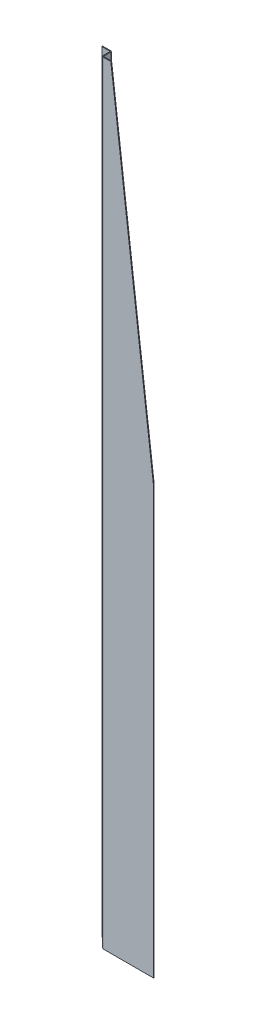
ISO-10303-21;
HEADER;
FILE_DESCRIPTION(('STEP AP214'),'2;1');
FILE_NAME('part.step','',(''),(''),'','','');
FILE_SCHEMA(('AUTOMOTIVE_DESIGN { 1 0 10303 214 1 1 1 1 }'));
ENDSEC;
DATA;
#1=APPLICATION_CONTEXT('core data for automotive mechanical design processes');
#2=APPLICATION_PROTOCOL_DEFINITION('international standard','automotive_design',2000,#1);
#3=PRODUCT_CONTEXT('',#1,'mechanical');
#4=PRODUCT('Part','Part','',(#3));
#5=PRODUCT_RELATED_PRODUCT_CATEGORY('part','',(#4));
#6=PRODUCT_DEFINITION_FORMATION('','',#4);
#7=PRODUCT_DEFINITION_CONTEXT('part definition',#1,'design');
#8=PRODUCT_DEFINITION('design','',#6,#7);
#9=PRODUCT_DEFINITION_SHAPE('','',#8);
#10=(LENGTH_UNIT() NAMED_UNIT(*) SI_UNIT(.MILLI.,.METRE.));
#11=(NAMED_UNIT(*) PLANE_ANGLE_UNIT() SI_UNIT($,.RADIAN.));
#12=(NAMED_UNIT(*) SI_UNIT($,.STERADIAN.) SOLID_ANGLE_UNIT());
#13=UNCERTAINTY_MEASURE_WITH_UNIT(LENGTH_MEASURE(1.E-05),#10,'distance_accuracy_value','');
#14=(GEOMETRIC_REPRESENTATION_CONTEXT(3) GLOBAL_UNCERTAINTY_ASSIGNED_CONTEXT((#13)) GLOBAL_UNIT_ASSIGNED_CONTEXT((#10,
#11,#12)) REPRESENTATION_CONTEXT('',''));
#15=CARTESIAN_POINT('',(0.,0.,0.));
#16=DIRECTION('',(0.,0.,1.));
#17=DIRECTION('',(1.,0.,0.));
#18=AXIS2_PLACEMENT_3D('',#15,#16,#17);
#19=CARTESIAN_POINT('',(-60.5,1810.,-21.9));
#20=DIRECTION('',(0.,0.,1.));
#21=DIRECTION('',(1.,0.,0.));
#22=AXIS2_PLACEMENT_3D('',#19,#20,#21);
#23=PLANE('',#22);
#24=DIRECTION('',(1.,0.,0.));
#25=VECTOR('',#24,1.);
#26=CARTESIAN_POINT('',(-60.5,1808.1,-21.9));
#27=LINE('',#26,#25);
#28=CARTESIAN_POINT('',(-80.5,1808.1,-21.9));
#29=VERTEX_POINT('',#28);
#30=CARTESIAN_POINT('',(-61.2366,1808.1,-21.9));
#31=VERTEX_POINT('',#30);
#32=EDGE_CURVE('E333',#29,#31,#27,.T.);
#33=ORIENTED_EDGE('',*,*,#32,.T.);
#34=DIRECTION('',(0.,-1.,0.));
#35=VECTOR('',#34,1.);
#36=CARTESIAN_POINT('',(-61.2366,1810.,-21.9));
#37=LINE('',#36,#35);
#38=CARTESIAN_POINT('',(-61.2366,1.90000000000001,-21.9));
#39=VERTEX_POINT('',#38);
#40=EDGE_CURVE('E69',#31,#39,#37,.T.);
#41=ORIENTED_EDGE('',*,*,#40,.T.);
#42=DIRECTION('',(1.,0.,0.));
#43=VECTOR('',#42,1.);
#44=CARTESIAN_POINT('',(-60.5,1.90000000000001,-21.9));
#45=LINE('',#44,#43);
#46=CARTESIAN_POINT('',(-80.5,1.90000000000001,-21.9));
#47=VERTEX_POINT('',#46);
#48=EDGE_CURVE('E209',#39,#47,#45,.F.);
#49=ORIENTED_EDGE('',*,*,#48,.T.);
#50=DIRECTION('',(0.,-1.,0.));
#51=VECTOR('',#50,1.);
#52=CARTESIAN_POINT('',(-80.5,1810.,-21.9));
#53=LINE('',#52,#51);
#54=EDGE_CURVE('E54',#29,#47,#53,.T.);
#55=ORIENTED_EDGE('',*,*,#54,.F.);
#56=EDGE_LOOP('',(#33,#41,#49,#55));
#57=FACE_BOUND('',#56,.T.);
#58=ADVANCED_FACE('F45',(#57),#23,.F.);
#59=CARTESIAN_POINT('',(-80.5,1810.,-20.));
#60=DIRECTION('',(-1.,0.,0.));
#61=DIRECTION('',(0.,0.,1.));
#62=AXIS2_PLACEMENT_3D('',#59,#60,#61);
#63=PLANE('',#62);
#64=DIRECTION('',(0.,-1.,0.));
#65=VECTOR('',#64,1.);
#66=CARTESIAN_POINT('',(-80.5,1810.,-20.));
#67=LINE('',#66,#65);
#68=CARTESIAN_POINT('',(-80.5,1808.1,-20.));
#69=VERTEX_POINT('',#68);
#70=CARTESIAN_POINT('',(-80.5,1.90000000000001,-20.));
#71=VERTEX_POINT('',#70);
#72=EDGE_CURVE('E189',#69,#71,#67,.T.);
#73=ORIENTED_EDGE('',*,*,#72,.F.);
#74=DIRECTION('',(0.,0.,1.));
#75=VECTOR('',#74,1.);
#76=CARTESIAN_POINT('',(-80.5,1808.1,-21.9));
#77=LINE('',#76,#75);
#78=EDGE_CURVE('E204',#69,#29,#77,.F.);
#79=ORIENTED_EDGE('',*,*,#78,.T.);
#80=ORIENTED_EDGE('',*,*,#54,.T.);
#81=DIRECTION('',(0.,0.,1.));
#82=VECTOR('',#81,1.);
#83=CARTESIAN_POINT('',(-80.5,1.9,-20.));
#84=LINE('',#83,#82);
#85=EDGE_CURVE('E203',#71,#47,#84,.F.);
#86=ORIENTED_EDGE('',*,*,#85,.F.);
#87=EDGE_LOOP('',(#73,#79,#80,#86));
#88=FACE_BOUND('',#87,.T.);
#89=ADVANCED_FACE('F202',(#88),#63,.T.);
#90=CARTESIAN_POINT('',(-60.5,1810.,-20.));
#91=DIRECTION('',(0.,0.,1.));
#92=DIRECTION('',(1.,0.,0.));
#93=AXIS2_PLACEMENT_3D('',#90,#91,#92);
#94=PLANE('',#93);
#95=DIRECTION('',(0.,-1.,0.));
#96=VECTOR('',#95,1.);
#97=CARTESIAN_POINT('',(-61.2366,1810.,-20.));
#98=LINE('',#97,#96);
#99=CARTESIAN_POINT('',(-61.2366,1808.1,-20.));
#100=VERTEX_POINT('',#99);
#101=CARTESIAN_POINT('',(-61.2366,1.90000000000001,-20.));
#102=VERTEX_POINT('',#101);
#103=EDGE_CURVE('E187',#100,#102,#98,.T.);
#104=ORIENTED_EDGE('',*,*,#103,.F.);
#105=DIRECTION('',(1.,0.,0.));
#106=VECTOR('',#105,1.);
#107=CARTESIAN_POINT('',(-70.8683,1808.1,-20.));
#108=LINE('',#107,#106);
#109=EDGE_CURVE('E181',#69,#100,#108,.T.);
#110=ORIENTED_EDGE('',*,*,#109,.F.);
#111=ORIENTED_EDGE('',*,*,#72,.T.);
#112=DIRECTION('',(-1.,0.,0.));
#113=VECTOR('',#112,1.);
#114=CARTESIAN_POINT('',(-60.5,1.90000000000001,-20.));
#115=LINE('',#114,#113);
#116=EDGE_CURVE('E212',#102,#71,#115,.T.);
#117=ORIENTED_EDGE('',*,*,#116,.F.);
#118=EDGE_LOOP('',(#104,#110,#111,#117));
#119=FACE_BOUND('',#118,.T.);
#120=ADVANCED_FACE('F356',(#119),#94,.T.);
#121=CARTESIAN_POINT('',(-61.2366,1810.,-19.2634));
#122=DIRECTION('',(0.,-1.,0.));
#123=DIRECTION('',(0.,0.,-1.));
#124=AXIS2_PLACEMENT_3D('',#121,#122,#123);
#125=CYLINDRICAL_SURFACE('',#124,0.7366);
#126=DIRECTION('',(0.,-1.,0.));
#127=VECTOR('',#126,1.);
#128=CARTESIAN_POINT('',(-60.5,1810.,-19.2634));
#129=LINE('',#128,#127);
#130=CARTESIAN_POINT('',(-60.5,1808.1,-19.2634));
#131=VERTEX_POINT('',#130);
#132=CARTESIAN_POINT('',(-60.5,1.90000000000001,-19.2634));
#133=VERTEX_POINT('',#132);
#134=EDGE_CURVE('E178',#131,#133,#129,.T.);
#135=ORIENTED_EDGE('',*,*,#134,.F.);
#136=CARTESIAN_POINT('',(-61.2366,1808.1,-19.2634));
#137=DIRECTION('',(0.,1.,0.));
#138=DIRECTION('',(0.,0.,1.));
#139=AXIS2_PLACEMENT_3D('',#136,#137,#138);
#140=CIRCLE('',#139,0.736599999999999);
#141=EDGE_CURVE('E150',#131,#100,#140,.T.);
#142=ORIENTED_EDGE('',*,*,#141,.T.);
#143=ORIENTED_EDGE('',*,*,#103,.T.);
#144=CARTESIAN_POINT('',(-61.2366,1.90000000000001,-19.2634));
#145=DIRECTION('',(0.,-1.,0.));
#146=DIRECTION('',(1.,0.,0.));
#147=AXIS2_PLACEMENT_3D('',#144,#145,#146);
#148=CIRCLE('',#147,0.736600000000002);
#149=EDGE_CURVE('E186',#102,#133,#148,.T.);
#150=ORIENTED_EDGE('',*,*,#149,.T.);
#151=EDGE_LOOP('',(#135,#142,#143,#150));
#152=FACE_BOUND('',#151,.T.);
#153=ADVANCED_FACE('F184',(#152),#125,.F.);
#154=CARTESIAN_POINT('',(-60.5,1810.,0.));
#155=DIRECTION('',(-1.,0.,0.));
#156=DIRECTION('',(0.,0.,1.));
#157=AXIS2_PLACEMENT_3D('',#154,#155,#156);
#158=PLANE('',#157);
#159=DIRECTION('',(0.,-1.,0.));
#160=VECTOR('',#159,1.);
#161=CARTESIAN_POINT('',(-60.5,1810.,-2.63659999999998));
#162=LINE('',#161,#160);
#163=CARTESIAN_POINT('',(-60.5,1808.1,-2.63659999999998));
#164=VERTEX_POINT('',#163);
#165=CARTESIAN_POINT('',(-60.5,1.90000000000001,-2.63659999999998));
#166=VERTEX_POINT('',#165);
#167=EDGE_CURVE('E180',#164,#166,#162,.T.);
#168=ORIENTED_EDGE('',*,*,#167,.F.);
#169=DIRECTION('',(0.,0.,-1.));
#170=VECTOR('',#169,1.);
#171=CARTESIAN_POINT('',(-60.5,1808.1,0.));
#172=LINE('',#171,#170);
#173=EDGE_CURVE('E166',#164,#131,#172,.T.);
#174=ORIENTED_EDGE('',*,*,#173,.T.);
#175=ORIENTED_EDGE('',*,*,#134,.T.);
#176=DIRECTION('',(0.,0.,-1.));
#177=VECTOR('',#176,1.);
#178=CARTESIAN_POINT('',(-60.5,1.90000000000001,2.22044604925031E-13));
#179=LINE('',#178,#177);
#180=EDGE_CURVE('E160',#166,#133,#179,.T.);
#181=ORIENTED_EDGE('',*,*,#180,.F.);
#182=EDGE_LOOP('',(#168,#174,#175,#181));
#183=FACE_BOUND('',#182,.T.);
#184=ADVANCED_FACE('F176',(#183),#158,.T.);
#185=CARTESIAN_POINT('',(-57.8634,1810.,-2.63659999999998));
#186=DIRECTION('',(0.,-1.,0.));
#187=DIRECTION('',(0.,0.,-1.));
#188=AXIS2_PLACEMENT_3D('',#185,#186,#187);
#189=CYLINDRICAL_SURFACE('',#188,2.6366);
#190=DIRECTION('',(0.,-1.,0.));
#191=VECTOR('',#190,1.);
#192=CARTESIAN_POINT('',(-57.8634,1810.,0.));
#193=LINE('',#192,#191);
#194=CARTESIAN_POINT('',(-57.8634,1808.1,0.));
#195=VERTEX_POINT('',#194);
#196=CARTESIAN_POINT('',(-57.8634,1.90000000000001,0.));
#197=VERTEX_POINT('',#196);
#198=EDGE_CURVE('E191',#195,#197,#193,.T.);
#199=ORIENTED_EDGE('',*,*,#198,.F.);
#200=CARTESIAN_POINT('',(-57.8634,1808.1,-2.63659999999998));
#201=DIRECTION('',(0.,-1.,0.));
#202=DIRECTION('',(0.,0.,-1.));
#203=AXIS2_PLACEMENT_3D('',#200,#201,#202);
#204=CIRCLE('',#203,2.6366);
#205=EDGE_CURVE('E172',#195,#164,#204,.T.);
#206=ORIENTED_EDGE('',*,*,#205,.T.);
#207=ORIENTED_EDGE('',*,*,#167,.T.);
#208=CARTESIAN_POINT('',(-57.8634,1.90000000000001,-2.63659999999998));
#209=DIRECTION('',(0.,1.,0.));
#210=DIRECTION('',(0.,0.,1.));
#211=AXIS2_PLACEMENT_3D('',#208,#209,#210);
#212=CIRCLE('',#211,2.6366);
#213=EDGE_CURVE('E228',#166,#197,#212,.T.);
#214=ORIENTED_EDGE('',*,*,#213,.T.);
#215=EDGE_LOOP('',(#199,#206,#207,#214));
#216=FACE_BOUND('',#215,.T.);
#217=ADVANCED_FACE('F272',(#216),#189,.T.);
#218=CARTESIAN_POINT('',(-57.8634,1810.,-2.63659999999998));
#219=DIRECTION('',(0.,-1.,0.));
#220=DIRECTION('',(0.,0.,-1.));
#221=AXIS2_PLACEMENT_3D('',#218,#219,#220);
#222=CYLINDRICAL_SURFACE('',#221,0.7366);
#223=CARTESIAN_POINT('',(-57.8634,1808.1,-2.63659999999998));
#224=DIRECTION('',(0.,-1.,0.));
#225=DIRECTION('',(0.,0.,-1.));
#226=AXIS2_PLACEMENT_3D('',#223,#224,#225);
#227=CIRCLE('',#226,0.7366);
#228=CARTESIAN_POINT('',(-57.8634,1808.1,-1.89999999999998));
#229=VERTEX_POINT('',#228);
#230=CARTESIAN_POINT('',(-58.6,1808.1,-2.63659999999998));
#231=VERTEX_POINT('',#230);
#232=EDGE_CURVE('E303',#229,#231,#227,.T.);
#233=ORIENTED_EDGE('',*,*,#232,.F.);
#234=DIRECTION('',(0.,-1.,0.));
#235=VECTOR('',#234,1.);
#236=CARTESIAN_POINT('',(-57.8634,1810.,-1.89999999999998));
#237=LINE('',#236,#235);
#238=CARTESIAN_POINT('',(-57.8634,1.90000000000001,-1.89999999999998));
#239=VERTEX_POINT('',#238);
#240=EDGE_CURVE('E250',#229,#239,#237,.T.);
#241=ORIENTED_EDGE('',*,*,#240,.T.);
#242=CARTESIAN_POINT('',(-57.8634,1.90000000000001,-2.63659999999998));
#243=DIRECTION('',(0.,-1.,0.));
#244=DIRECTION('',(0.,0.,-1.));
#245=AXIS2_PLACEMENT_3D('',#242,#243,#244);
#246=CIRCLE('',#245,0.7366);
#247=CARTESIAN_POINT('',(-58.6,1.90000000000001,-2.63659999999998));
#248=VERTEX_POINT('',#247);
#249=EDGE_CURVE('E225',#248,#239,#246,.F.);
#250=ORIENTED_EDGE('',*,*,#249,.F.);
#251=DIRECTION('',(0.,-1.,0.));
#252=VECTOR('',#251,1.);
#253=CARTESIAN_POINT('',(-58.6,1810.,-2.63659999999998));
#254=LINE('',#253,#252);
#255=EDGE_CURVE('E248',#231,#248,#254,.T.);
#256=ORIENTED_EDGE('',*,*,#255,.F.);
#257=EDGE_LOOP('',(#233,#241,#250,#256));
#258=FACE_BOUND('',#257,.T.);
#259=ADVANCED_FACE('F302',(#258),#222,.F.);
#260=CARTESIAN_POINT('',(-58.6,1810.,0.));
#261=DIRECTION('',(-1.,0.,0.));
#262=DIRECTION('',(0.,0.,1.));
#263=AXIS2_PLACEMENT_3D('',#260,#261,#262);
#264=PLANE('',#263);
#265=DIRECTION('',(0.,0.,-1.));
#266=VECTOR('',#265,1.);
#267=CARTESIAN_POINT('',(-58.6,1808.1,-10.95));
#268=LINE('',#267,#266);
#269=CARTESIAN_POINT('',(-58.6,1808.1,-19.2634));
#270=VERTEX_POINT('',#269);
#271=EDGE_CURVE('E169',#231,#270,#268,.T.);
#272=ORIENTED_EDGE('',*,*,#271,.F.);
#273=ORIENTED_EDGE('',*,*,#255,.T.);
#274=DIRECTION('',(0.,0.,1.));
#275=VECTOR('',#274,1.);
#276=CARTESIAN_POINT('',(-58.6,1.90000000000001,0.));
#277=LINE('',#276,#275);
#278=CARTESIAN_POINT('',(-58.6,1.90000000000001,-19.2634));
#279=VERTEX_POINT('',#278);
#280=EDGE_CURVE('E281',#248,#279,#277,.F.);
#281=ORIENTED_EDGE('',*,*,#280,.T.);
#282=DIRECTION('',(0.,-1.,0.));
#283=VECTOR('',#282,1.);
#284=CARTESIAN_POINT('',(-58.6,1810.,-19.2634));
#285=LINE('',#284,#283);
#286=EDGE_CURVE('E246',#270,#279,#285,.T.);
#287=ORIENTED_EDGE('',*,*,#286,.F.);
#288=EDGE_LOOP('',(#272,#273,#281,#287));
#289=FACE_BOUND('',#288,.T.);
#290=ADVANCED_FACE('F298',(#289),#264,.F.);
#291=CARTESIAN_POINT('',(-61.2366,1810.,-19.2634));
#292=DIRECTION('',(0.,-1.,0.));
#293=DIRECTION('',(0.,0.,-1.));
#294=AXIS2_PLACEMENT_3D('',#291,#292,#293);
#295=CYLINDRICAL_SURFACE('',#294,2.6366);
#296=CARTESIAN_POINT('',(-61.2366,1808.1,-19.2634));
#297=DIRECTION('',(0.,-1.,0.));
#298=DIRECTION('',(0.,0.,-1.));
#299=AXIS2_PLACEMENT_3D('',#296,#297,#298);
#300=CIRCLE('',#299,2.6366);
#301=EDGE_CURVE('E171',#270,#31,#300,.F.);
#302=ORIENTED_EDGE('',*,*,#301,.F.);
#303=ORIENTED_EDGE('',*,*,#286,.T.);
#304=CARTESIAN_POINT('',(-61.2366,1.90000000000001,-19.2634));
#305=DIRECTION('',(0.,-1.,0.));
#306=DIRECTION('',(1.,0.,0.));
#307=AXIS2_PLACEMENT_3D('',#304,#305,#306);
#308=CIRCLE('',#307,2.6366);
#309=EDGE_CURVE('E284',#39,#279,#308,.T.);
#310=ORIENTED_EDGE('',*,*,#309,.F.);
#311=ORIENTED_EDGE('',*,*,#40,.F.);
#312=EDGE_LOOP('',(#302,#303,#310,#311));
#313=FACE_BOUND('',#312,.T.);
#314=ADVANCED_FACE('F342',(#313),#295,.T.);
#315=CARTESIAN_POINT('',(60.5,1810.,0.));
#316=DIRECTION('',(0.,0.,1.));
#317=DIRECTION('',(1.,0.,0.));
#318=AXIS2_PLACEMENT_3D('',#315,#316,#317);
#319=PLANE('',#318);
#320=DIRECTION('',(0.122526572002646,-0.992465233221436,0.));
#321=VECTOR('',#320,1.);
#322=CARTESIAN_POINT('',(60.5,1000.,0.));
#323=LINE('',#322,#321);
#324=CARTESIAN_POINT('',(-39.2654320987654,1808.1,0.));
#325=VERTEX_POINT('',#324);
#326=CARTESIAN_POINT('',(60.5,1000.,0.));
#327=VERTEX_POINT('',#326);
#328=EDGE_CURVE('E49',#325,#327,#323,.T.);
#329=ORIENTED_EDGE('',*,*,#328,.F.);
#330=DIRECTION('',(-1.,0.,0.));
#331=VECTOR('',#330,1.);
#332=CARTESIAN_POINT('',(60.5,1808.1,0.));
#333=LINE('',#332,#331);
#334=EDGE_CURVE('E61',#325,#195,#333,.T.);
#335=ORIENTED_EDGE('',*,*,#334,.T.);
#336=ORIENTED_EDGE('',*,*,#198,.T.);
#337=DIRECTION('',(0.,-1.,0.));
#338=VECTOR('',#337,1.);
#339=CARTESIAN_POINT('',(-57.8634,1810.,0.));
#340=LINE('',#339,#338);
#341=CARTESIAN_POINT('',(-57.8634,0.,0.));
#342=VERTEX_POINT('',#341);
#343=EDGE_CURVE('E216',#197,#342,#340,.T.);
#344=ORIENTED_EDGE('',*,*,#343,.T.);
#345=DIRECTION('',(-1.,0.,0.));
#346=VECTOR('',#345,1.);
#347=CARTESIAN_POINT('',(60.5,0.,0.));
#348=LINE('',#347,#346);
#349=CARTESIAN_POINT('',(60.5,0.,0.));
#350=VERTEX_POINT('',#349);
#351=EDGE_CURVE('E236',#350,#342,#348,.T.);
#352=ORIENTED_EDGE('',*,*,#351,.F.);
#353=DIRECTION('',(0.,-1.,0.));
#354=VECTOR('',#353,1.);
#355=CARTESIAN_POINT('',(60.5,1810.,0.));
#356=LINE('',#355,#354);
#357=EDGE_CURVE('E254',#327,#350,#356,.T.);
#358=ORIENTED_EDGE('',*,*,#357,.F.);
#359=EDGE_LOOP('',(#329,#335,#336,#344,#352,#358));
#360=FACE_BOUND('',#359,.T.);
#361=ADVANCED_FACE('F258',(#360),#319,.T.);
#362=CARTESIAN_POINT('',(60.5,1810.,-1.89999999999998));
#363=DIRECTION('',(0.,0.,1.));
#364=DIRECTION('',(1.,0.,0.));
#365=AXIS2_PLACEMENT_3D('',#362,#363,#364);
#366=PLANE('',#365);
#367=DIRECTION('',(-1.,0.,0.));
#368=VECTOR('',#367,1.);
#369=CARTESIAN_POINT('',(-48.5644160493827,1808.1,-1.89999999999998));
#370=LINE('',#369,#368);
#371=CARTESIAN_POINT('',(-39.2654320987654,1808.1,-1.89999999999998));
#372=VERTEX_POINT('',#371);
#373=EDGE_CURVE('E309',#372,#229,#370,.T.);
#374=ORIENTED_EDGE('',*,*,#373,.F.);
#375=DIRECTION('',(0.122526572002646,-0.992465233221436,0.));
#376=VECTOR('',#375,1.);
#377=CARTESIAN_POINT('',(-37.998723915328,1797.83966371416,-1.89999999999998));
#378=LINE('',#377,#376);
#379=CARTESIAN_POINT('',(60.5,1000.,-1.89999999999998));
#380=VERTEX_POINT('',#379);
#381=EDGE_CURVE('E234',#372,#380,#378,.T.);
#382=ORIENTED_EDGE('',*,*,#381,.T.);
#383=DIRECTION('',(0.,-1.,0.));
#384=VECTOR('',#383,1.);
#385=CARTESIAN_POINT('',(60.5,1810.,-1.89999999999998));
#386=LINE('',#385,#384);
#387=CARTESIAN_POINT('',(60.5,0.,-1.89999999999998));
#388=VERTEX_POINT('',#387);
#389=EDGE_CURVE('E252',#380,#388,#386,.T.);
#390=ORIENTED_EDGE('',*,*,#389,.T.);
#391=DIRECTION('',(1.,0.,0.));
#392=VECTOR('',#391,1.);
#393=CARTESIAN_POINT('',(60.5,0.,-1.89999999999998));
#394=LINE('',#393,#392);
#395=CARTESIAN_POINT('',(-57.8634,0.,-1.89999999999998));
#396=VERTEX_POINT('',#395);
#397=EDGE_CURVE('E242',#388,#396,#394,.F.);
#398=ORIENTED_EDGE('',*,*,#397,.T.);
#399=DIRECTION('',(0.,-1.,0.));
#400=VECTOR('',#399,1.);
#401=CARTESIAN_POINT('',(-57.8634,1810.,-1.89999999999998));
#402=LINE('',#401,#400);
#403=EDGE_CURVE('E214',#239,#396,#402,.T.);
#404=ORIENTED_EDGE('',*,*,#403,.F.);
#405=ORIENTED_EDGE('',*,*,#240,.F.);
#406=EDGE_LOOP('',(#374,#382,#390,#398,#404,#405));
#407=FACE_BOUND('',#406,.T.);
#408=ADVANCED_FACE('F307',(#407),#366,.F.);
#409=CARTESIAN_POINT('',(60.5,1000.,-21.9));
#410=DIRECTION('',(-0.992465233221436,-0.122526572002646,0.));
#411=DIRECTION('',(0.122526572002646,-0.992465233221436,0.));
#412=AXIS2_PLACEMENT_3D('',#409,#410,#411);
#413=PLANE('',#412);
#414=DIRECTION('',(0.,0.,-1.));
#415=VECTOR('',#414,1.);
#416=CARTESIAN_POINT('',(-39.2654320987654,1808.1,0.));
#417=LINE('',#416,#415);
#418=EDGE_CURVE('E321',#372,#325,#417,.F.);
#419=ORIENTED_EDGE('',*,*,#418,.T.);
#420=ORIENTED_EDGE('',*,*,#328,.T.);
#421=DIRECTION('',(0.,0.,1.));
#422=VECTOR('',#421,1.);
#423=CARTESIAN_POINT('',(60.5,1000.,-21.9));
#424=LINE('',#423,#422);
#425=EDGE_CURVE('E231',#380,#327,#424,.T.);
#426=ORIENTED_EDGE('',*,*,#425,.F.);
#427=ORIENTED_EDGE('',*,*,#381,.F.);
#428=EDGE_LOOP('',(#419,#420,#426,#427));
#429=FACE_BOUND('',#428,.T.);
#430=ADVANCED_FACE('F320',(#429),#413,.F.);
#431=CARTESIAN_POINT('',(-58.6,0.,-2.63659999999998));
#432=DIRECTION('',(0.,-1.,0.));
#433=DIRECTION('',(0.,0.,-1.));
#434=AXIS2_PLACEMENT_3D('',#431,#432,#433);
#435=PLANE('',#434);
#436=ORIENTED_EDGE('',*,*,#351,.T.);
#437=DIRECTION('',(0.,0.,-1.));
#438=VECTOR('',#437,1.);
#439=CARTESIAN_POINT('',(-57.8634,0.,0.));
#440=LINE('',#439,#438);
#441=EDGE_CURVE('E11',#342,#396,#440,.T.);
#442=ORIENTED_EDGE('',*,*,#441,.T.);
#443=ORIENTED_EDGE('',*,*,#397,.F.);
#444=DIRECTION('',(0.,0.,1.));
#445=VECTOR('',#444,1.);
#446=CARTESIAN_POINT('',(60.5,0.,-1.89999999999998));
#447=LINE('',#446,#445);
#448=EDGE_CURVE('E239',#388,#350,#447,.T.);
#449=ORIENTED_EDGE('',*,*,#448,.T.);
#450=EDGE_LOOP('',(#436,#442,#443,#449));
#451=FACE_BOUND('',#450,.T.);
#452=ADVANCED_FACE('F47',(#451),#435,.T.);
#453=CARTESIAN_POINT('',(60.5,1810.,-1.89999999999998));
#454=DIRECTION('',(1.,0.,0.));
#455=DIRECTION('',(0.,0.,-1.));
#456=AXIS2_PLACEMENT_3D('',#453,#454,#455);
#457=PLANE('',#456);
#458=ORIENTED_EDGE('',*,*,#425,.T.);
#459=ORIENTED_EDGE('',*,*,#357,.T.);
#460=ORIENTED_EDGE('',*,*,#448,.F.);
#461=ORIENTED_EDGE('',*,*,#389,.F.);
#462=EDGE_LOOP('',(#458,#459,#460,#461));
#463=FACE_BOUND('',#462,.T.);
#464=ADVANCED_FACE('F316',(#463),#457,.T.);
#465=CARTESIAN_POINT('',(-57.8634,1.90000000000001,-2.63659999999998));
#466=DIRECTION('',(0.,-1.,0.));
#467=DIRECTION('',(0.,0.,-1.));
#468=AXIS2_PLACEMENT_3D('',#465,#466,#467);
#469=PLANE('',#468);
#470=DIRECTION('',(1.,0.,0.));
#471=VECTOR('',#470,1.);
#472=CARTESIAN_POINT('',(-60.5,1.90000000000001,-2.63659999999998));
#473=LINE('',#472,#471);
#474=EDGE_CURVE('E277',#166,#248,#473,.T.);
#475=ORIENTED_EDGE('',*,*,#474,.T.);
#476=ORIENTED_EDGE('',*,*,#249,.T.);
#477=DIRECTION('',(0.,0.,1.));
#478=VECTOR('',#477,1.);
#479=CARTESIAN_POINT('',(-57.8634,1.90000000000001,-1.89999999999998));
#480=LINE('',#479,#478);
#481=EDGE_CURVE('E222',#239,#197,#480,.T.);
#482=ORIENTED_EDGE('',*,*,#481,.T.);
#483=ORIENTED_EDGE('',*,*,#213,.F.);
#484=EDGE_LOOP('',(#475,#476,#482,#483));
#485=FACE_BOUND('',#484,.T.);
#486=ADVANCED_FACE('F267',(#485),#469,.T.);
#487=CARTESIAN_POINT('',(-57.8634,0.950000000000006,-1.89999999999998));
#488=DIRECTION('',(-1.,0.,0.));
#489=DIRECTION('',(0.,-1.,0.));
#490=AXIS2_PLACEMENT_3D('',#487,#488,#489);
#491=PLANE('',#490);
#492=ORIENTED_EDGE('',*,*,#403,.T.);
#493=ORIENTED_EDGE('',*,*,#441,.F.);
#494=ORIENTED_EDGE('',*,*,#343,.F.);
#495=ORIENTED_EDGE('',*,*,#481,.F.);
#496=EDGE_LOOP('',(#492,#493,#494,#495));
#497=FACE_BOUND('',#496,.T.);
#498=ADVANCED_FACE('F271',(#497),#491,.T.);
#499=CARTESIAN_POINT('',(-60.5,1.90000000000001,-20.));
#500=DIRECTION('',(0.,1.,0.));
#501=DIRECTION('',(-1.,0.,0.));
#502=AXIS2_PLACEMENT_3D('',#499,#500,#501);
#503=PLANE('',#502);
#504=ORIENTED_EDGE('',*,*,#116,.T.);
#505=ORIENTED_EDGE('',*,*,#85,.T.);
#506=ORIENTED_EDGE('',*,*,#48,.F.);
#507=DIRECTION('',(0.,0.,-1.));
#508=VECTOR('',#507,1.);
#509=CARTESIAN_POINT('',(-61.2366,1.90000000000001,-20.));
#510=LINE('',#509,#508);
#511=EDGE_CURVE('E282',#102,#39,#510,.T.);
#512=ORIENTED_EDGE('',*,*,#511,.F.);
#513=EDGE_LOOP('',(#504,#505,#506,#512));
#514=FACE_BOUND('',#513,.T.);
#515=ADVANCED_FACE('F207',(#514),#503,.F.);
#516=CARTESIAN_POINT('',(-61.2366,1.90000000000001,-19.2634));
#517=DIRECTION('',(0.,1.,0.));
#518=DIRECTION('',(-1.,0.,0.));
#519=AXIS2_PLACEMENT_3D('',#516,#517,#518);
#520=PLANE('',#519);
#521=ORIENTED_EDGE('',*,*,#511,.T.);
#522=ORIENTED_EDGE('',*,*,#309,.T.);
#523=DIRECTION('',(1.,0.,0.));
#524=VECTOR('',#523,1.);
#525=CARTESIAN_POINT('',(-60.5,1.90000000000001,-19.2634));
#526=LINE('',#525,#524);
#527=EDGE_CURVE('E286',#133,#279,#526,.T.);
#528=ORIENTED_EDGE('',*,*,#527,.F.);
#529=ORIENTED_EDGE('',*,*,#149,.F.);
#530=EDGE_LOOP('',(#521,#522,#528,#529));
#531=FACE_BOUND('',#530,.T.);
#532=ADVANCED_FACE('F294',(#531),#520,.F.);
#533=CARTESIAN_POINT('',(-60.5,1.90000000000001,2.22044604925031E-13));
#534=DIRECTION('',(0.,1.,0.));
#535=DIRECTION('',(0.,0.,-1.));
#536=AXIS2_PLACEMENT_3D('',#533,#534,#535);
#537=PLANE('',#536);
#538=ORIENTED_EDGE('',*,*,#180,.T.);
#539=ORIENTED_EDGE('',*,*,#527,.T.);
#540=ORIENTED_EDGE('',*,*,#280,.F.);
#541=ORIENTED_EDGE('',*,*,#474,.F.);
#542=EDGE_LOOP('',(#538,#539,#540,#541));
#543=FACE_BOUND('',#542,.T.);
#544=ADVANCED_FACE('F278',(#543),#537,.F.);
#545=CARTESIAN_POINT('',(-60.5,1808.1,0.));
#546=DIRECTION('',(0.,-1.,0.));
#547=DIRECTION('',(0.,0.,-1.));
#548=AXIS2_PLACEMENT_3D('',#545,#546,#547);
#549=PLANE('',#548);
#550=DIRECTION('',(-1.,0.,0.));
#551=VECTOR('',#550,1.);
#552=CARTESIAN_POINT('',(-58.6,1808.1,-2.63659999999998));
#553=LINE('',#552,#551);
#554=EDGE_CURVE('E327',#231,#164,#553,.T.);
#555=ORIENTED_EDGE('',*,*,#554,.F.);
#556=ORIENTED_EDGE('',*,*,#271,.T.);
#557=DIRECTION('',(-1.,0.,0.));
#558=VECTOR('',#557,1.);
#559=CARTESIAN_POINT('',(-58.6,1808.1,-19.2634));
#560=LINE('',#559,#558);
#561=EDGE_CURVE('E153',#270,#131,#560,.T.);
#562=ORIENTED_EDGE('',*,*,#561,.T.);
#563=ORIENTED_EDGE('',*,*,#173,.F.);
#564=EDGE_LOOP('',(#555,#556,#562,#563));
#565=FACE_BOUND('',#564,.T.);
#566=ADVANCED_FACE('F165',(#565),#549,.F.);
#567=CARTESIAN_POINT('',(-57.8634,1808.1,-2.63659999999998));
#568=DIRECTION('',(0.,1.,0.));
#569=DIRECTION('',(0.,0.,1.));
#570=AXIS2_PLACEMENT_3D('',#567,#568,#569);
#571=PLANE('',#570);
#572=ORIENTED_EDGE('',*,*,#232,.T.);
#573=ORIENTED_EDGE('',*,*,#554,.T.);
#574=ORIENTED_EDGE('',*,*,#205,.F.);
#575=DIRECTION('',(0.,0.,1.));
#576=VECTOR('',#575,1.);
#577=CARTESIAN_POINT('',(-57.8634,1808.1,-1.89999999999998));
#578=LINE('',#577,#576);
#579=EDGE_CURVE('E329',#229,#195,#578,.T.);
#580=ORIENTED_EDGE('',*,*,#579,.F.);
#581=EDGE_LOOP('',(#572,#573,#574,#580));
#582=FACE_BOUND('',#581,.T.);
#583=ADVANCED_FACE('F425',(#582),#571,.T.);
#584=CARTESIAN_POINT('',(60.5,1808.1,0.));
#585=DIRECTION('',(0.,-1.,0.));
#586=DIRECTION('',(-1.,0.,0.));
#587=AXIS2_PLACEMENT_3D('',#584,#585,#586);
#588=PLANE('',#587);
#589=ORIENTED_EDGE('',*,*,#418,.F.);
#590=ORIENTED_EDGE('',*,*,#373,.T.);
#591=ORIENTED_EDGE('',*,*,#579,.T.);
#592=ORIENTED_EDGE('',*,*,#334,.F.);
#593=EDGE_LOOP('',(#589,#590,#591,#592));
#594=FACE_BOUND('',#593,.T.);
#595=ADVANCED_FACE('F437',(#594),#588,.F.);
#596=CARTESIAN_POINT('',(-61.2366,1808.1,-19.2634));
#597=DIRECTION('',(0.,-1.,0.));
#598=DIRECTION('',(0.,0.,-1.));
#599=AXIS2_PLACEMENT_3D('',#596,#597,#598);
#600=PLANE('',#599);
#601=ORIENTED_EDGE('',*,*,#301,.T.);
#602=DIRECTION('',(0.,0.,1.));
#603=VECTOR('',#602,1.);
#604=CARTESIAN_POINT('',(-61.2366,1808.1,-21.9));
#605=LINE('',#604,#603);
#606=EDGE_CURVE('E156',#31,#100,#605,.T.);
#607=ORIENTED_EDGE('',*,*,#606,.T.);
#608=ORIENTED_EDGE('',*,*,#141,.F.);
#609=ORIENTED_EDGE('',*,*,#561,.F.);
#610=EDGE_LOOP('',(#601,#607,#608,#609));
#611=FACE_BOUND('',#610,.T.);
#612=ADVANCED_FACE('F152',(#611),#600,.F.);
#613=CARTESIAN_POINT('',(-60.5,1808.1,-21.9));
#614=DIRECTION('',(0.,-1.,0.));
#615=DIRECTION('',(1.,0.,0.));
#616=AXIS2_PLACEMENT_3D('',#613,#614,#615);
#617=PLANE('',#616);
#618=ORIENTED_EDGE('',*,*,#109,.T.);
#619=ORIENTED_EDGE('',*,*,#606,.F.);
#620=ORIENTED_EDGE('',*,*,#32,.F.);
#621=ORIENTED_EDGE('',*,*,#78,.F.);
#622=EDGE_LOOP('',(#618,#619,#620,#621));
#623=FACE_BOUND('',#622,.T.);
#624=ADVANCED_FACE('F340',(#623),#617,.F.);
#625=CLOSED_SHELL('',(#58,#89,#120,#153,#184,#217,#259,#290,#314,#361,#408,#430,#452,#464,#486,
#498,#515,#532,#544,#566,#583,#595,#612,#624));
#626=MANIFOLD_SOLID_BREP('B2',#625);
#627=ADVANCED_BREP_SHAPE_REPRESENTATION('',(#18,#626),#14);
#628=SHAPE_DEFINITION_REPRESENTATION(#9,#627);
ENDSEC;
END-ISO-10303-21;
